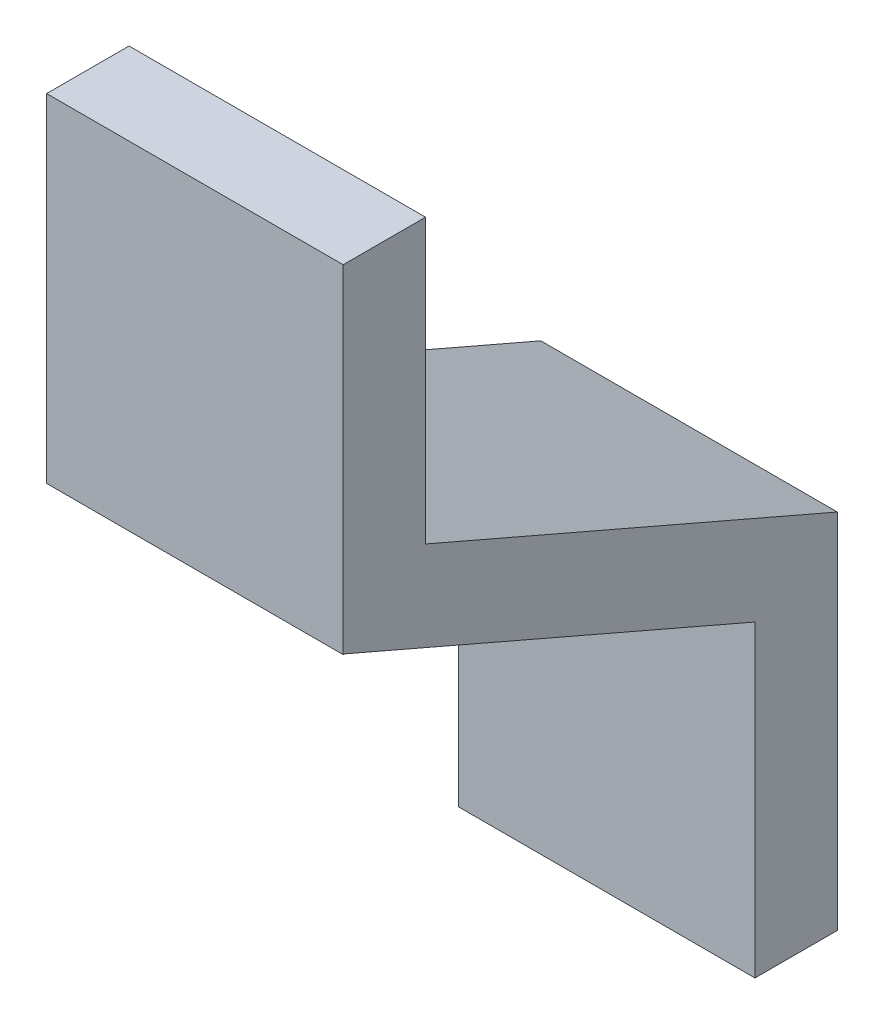
ISO-10303-21;
HEADER;
FILE_DESCRIPTION(('STEP AP214'),'2;1');
FILE_NAME('part.step','',(''),(''),'','','');
FILE_SCHEMA(('AUTOMOTIVE_DESIGN { 1 0 10303 214 1 1 1 1 }'));
ENDSEC;
DATA;
#1=APPLICATION_CONTEXT('core data for automotive mechanical design processes');
#2=APPLICATION_PROTOCOL_DEFINITION('international standard','automotive_design',2000,#1);
#3=PRODUCT_CONTEXT('',#1,'mechanical');
#4=PRODUCT('Part','Part','',(#3));
#5=PRODUCT_RELATED_PRODUCT_CATEGORY('part','',(#4));
#6=PRODUCT_DEFINITION_FORMATION('','',#4);
#7=PRODUCT_DEFINITION_CONTEXT('part definition',#1,'design');
#8=PRODUCT_DEFINITION('design','',#6,#7);
#9=PRODUCT_DEFINITION_SHAPE('','',#8);
#10=(LENGTH_UNIT() NAMED_UNIT(*) SI_UNIT(.MILLI.,.METRE.));
#11=(NAMED_UNIT(*) PLANE_ANGLE_UNIT() SI_UNIT($,.RADIAN.));
#12=(NAMED_UNIT(*) SI_UNIT($,.STERADIAN.) SOLID_ANGLE_UNIT());
#13=UNCERTAINTY_MEASURE_WITH_UNIT(LENGTH_MEASURE(1.E-05),#10,'distance_accuracy_value','');
#14=(GEOMETRIC_REPRESENTATION_CONTEXT(3) GLOBAL_UNCERTAINTY_ASSIGNED_CONTEXT((#13)) GLOBAL_UNIT_ASSIGNED_CONTEXT((#10,
#11,#12)) REPRESENTATION_CONTEXT('',''));
#15=CARTESIAN_POINT('',(0.,0.,0.));
#16=DIRECTION('',(0.,0.,1.));
#17=DIRECTION('',(1.,0.,0.));
#18=AXIS2_PLACEMENT_3D('',#15,#16,#17);
#19=CARTESIAN_POINT('',(9.82,0.999999996424,0.5));
#20=DIRECTION('',(0.,1.,0.));
#21=DIRECTION('',(0.,0.,1.));
#22=AXIS2_PLACEMENT_3D('',#19,#20,#21);
#23=PLANE('',#22);
#24=DIRECTION('',(1.,0.,0.));
#25=VECTOR('',#24,1.);
#26=CARTESIAN_POINT('',(9.82,0.999999996424,0.5));
#27=LINE('',#26,#25);
#28=CARTESIAN_POINT('',(10.180000014305,0.999999996424,0.5));
#29=VERTEX_POINT('',#28);
#30=CARTESIAN_POINT('',(9.82,0.999999996424,0.5));
#31=VERTEX_POINT('',#30);
#32=EDGE_CURVE('E140',#29,#31,#27,.F.);
#33=ORIENTED_EDGE('',*,*,#32,.T.);
#34=DIRECTION('',(0.,0.,-1.));
#35=VECTOR('',#34,1.);
#36=CARTESIAN_POINT('',(9.82,0.999999996424,0.));
#37=LINE('',#36,#35);
#38=CARTESIAN_POINT('',(9.82,0.999999996424,0.60000000149));
#39=VERTEX_POINT('',#38);
#40=EDGE_CURVE('E133',#31,#39,#37,.F.);
#41=ORIENTED_EDGE('',*,*,#40,.T.);
#42=DIRECTION('',(1.,0.,0.));
#43=VECTOR('',#42,1.);
#44=CARTESIAN_POINT('',(9.82,0.999999996424,0.60000000149));
#45=LINE('',#44,#43);
#46=CARTESIAN_POINT('',(10.180000014305,0.999999996424,0.60000000149));
#47=VERTEX_POINT('',#46);
#48=EDGE_CURVE('E129',#47,#39,#45,.F.);
#49=ORIENTED_EDGE('',*,*,#48,.F.);
#50=DIRECTION('',(0.,0.,-1.));
#51=VECTOR('',#50,1.);
#52=CARTESIAN_POINT('',(10.180000014305,0.999999996424,0.));
#53=LINE('',#52,#51);
#54=EDGE_CURVE('E106',#29,#47,#53,.F.);
#55=ORIENTED_EDGE('',*,*,#54,.F.);
#56=EDGE_LOOP('',(#33,#41,#49,#55));
#57=FACE_BOUND('',#56,.T.);
#58=ADVANCED_FACE('F17',(#57),#23,.T.);
#59=CARTESIAN_POINT('',(9.82,0.59,0.60000000149));
#60=DIRECTION('',(0.,0.,1.));
#61=DIRECTION('',(1.,0.,0.));
#62=AXIS2_PLACEMENT_3D('',#59,#60,#61);
#63=PLANE('',#62);
#64=DIRECTION('',(0.,1.,0.));
#65=VECTOR('',#64,1.);
#66=CARTESIAN_POINT('',(9.82,0.44,0.60000000149));
#67=LINE('',#66,#65);
#68=CARTESIAN_POINT('',(9.82,0.59,0.60000000149));
#69=VERTEX_POINT('',#68);
#70=EDGE_CURVE('E136',#39,#69,#67,.F.);
#71=ORIENTED_EDGE('',*,*,#70,.T.);
#72=DIRECTION('',(1.,0.,0.));
#73=VECTOR('',#72,1.);
#74=CARTESIAN_POINT('',(9.82,0.59,0.60000000149));
#75=LINE('',#74,#73);
#76=CARTESIAN_POINT('',(10.180000014305,0.59,0.60000000149));
#77=VERTEX_POINT('',#76);
#78=EDGE_CURVE('E92',#69,#77,#75,.T.);
#79=ORIENTED_EDGE('',*,*,#78,.T.);
#80=DIRECTION('',(0.,1.,0.));
#81=VECTOR('',#80,1.);
#82=CARTESIAN_POINT('',(10.180000014305,0.44,0.60000000149));
#83=LINE('',#82,#81);
#84=EDGE_CURVE('E73',#47,#77,#83,.F.);
#85=ORIENTED_EDGE('',*,*,#84,.F.);
#86=ORIENTED_EDGE('',*,*,#48,.T.);
#87=EDGE_LOOP('',(#71,#79,#85,#86));
#88=FACE_BOUND('',#87,.T.);
#89=ADVANCED_FACE('F285',(#88),#63,.T.);
#90=CARTESIAN_POINT('',(9.82,0.59,0.5));
#91=DIRECTION('',(0.,1.,0.));
#92=DIRECTION('',(0.,0.,1.));
#93=AXIS2_PLACEMENT_3D('',#90,#91,#92);
#94=PLANE('',#93);
#95=DIRECTION('',(1.,0.,0.));
#96=VECTOR('',#95,1.);
#97=CARTESIAN_POINT('',(9.82,0.590000000000416,0.59842599626982));
#98=LINE('',#97,#96);
#99=CARTESIAN_POINT('',(10.180000014305,0.590000000000104,0.598425996269911));
#100=VERTEX_POINT('',#99);
#101=CARTESIAN_POINT('',(9.82,0.590000000000104,0.59842599626991));
#102=VERTEX_POINT('',#101);
#103=EDGE_CURVE('E84',#100,#102,#98,.F.);
#104=ORIENTED_EDGE('',*,*,#103,.F.);
#105=DIRECTION('',(0.,0.,-1.));
#106=VECTOR('',#105,1.);
#107=CARTESIAN_POINT('',(10.180000014305,0.59,0.));
#108=LINE('',#107,#106);
#109=EDGE_CURVE('E20',#77,#100,#108,.T.);
#110=ORIENTED_EDGE('',*,*,#109,.F.);
#111=ORIENTED_EDGE('',*,*,#78,.F.);
#112=DIRECTION('',(0.,0.,1.));
#113=VECTOR('',#112,1.);
#114=CARTESIAN_POINT('',(9.82,0.59,0.5));
#115=LINE('',#114,#113);
#116=EDGE_CURVE('E87',#69,#102,#115,.F.);
#117=ORIENTED_EDGE('',*,*,#116,.T.);
#118=EDGE_LOOP('',(#104,#110,#111,#117));
#119=FACE_BOUND('',#118,.T.);
#120=ADVANCED_FACE('F85',(#119),#94,.F.);
#121=CARTESIAN_POINT('',(9.82,0.348224508223,0.03971472531736));
#122=DIRECTION('',(0.,-0.917754904098641,0.397147247255844));
#123=DIRECTION('',(0.,-0.397147247255844,-0.917754904098641));
#124=AXIS2_PLACEMENT_3D('',#121,#122,#123);
#125=PLANE('',#124);
#126=DIRECTION('',(0.,-0.397147247255413,-0.917754904098827));
#127=VECTOR('',#126,1.);
#128=CARTESIAN_POINT('',(10.180000014305,0.59,0.59842599627));
#129=LINE('',#128,#127);
#130=CARTESIAN_POINT('',(10.180000014305,0.37431222660502,0.10000000149));
#131=VERTEX_POINT('',#130);
#132=EDGE_CURVE('E80',#100,#131,#129,.T.);
#133=ORIENTED_EDGE('',*,*,#132,.F.);
#134=ORIENTED_EDGE('',*,*,#103,.T.);
#135=DIRECTION('',(0.,-0.397147247255413,-0.917754904098827));
#136=VECTOR('',#135,1.);
#137=CARTESIAN_POINT('',(9.82,0.59,0.59842599627));
#138=LINE('',#137,#136);
#139=CARTESIAN_POINT('',(9.82,0.374312226605,0.10000000149));
#140=VERTEX_POINT('',#139);
#141=EDGE_CURVE('E122',#102,#140,#138,.T.);
#142=ORIENTED_EDGE('',*,*,#141,.T.);
#143=DIRECTION('',(1.,0.,0.));
#144=VECTOR('',#143,1.);
#145=CARTESIAN_POINT('',(9.82,0.374312226605,0.10000000149));
#146=LINE('',#145,#144);
#147=EDGE_CURVE('E91',#131,#140,#146,.F.);
#148=ORIENTED_EDGE('',*,*,#147,.F.);
#149=EDGE_LOOP('',(#133,#134,#142,#148));
#150=FACE_BOUND('',#149,.T.);
#151=ADVANCED_FACE('F94',(#150),#125,.T.);
#152=CARTESIAN_POINT('',(9.82,0.,0.10000000149));
#153=DIRECTION('',(0.,0.,1.));
#154=DIRECTION('',(1.,0.,0.));
#155=AXIS2_PLACEMENT_3D('',#152,#153,#154);
#156=PLANE('',#155);
#157=ORIENTED_EDGE('',*,*,#147,.T.);
#158=DIRECTION('',(0.,1.,0.));
#159=VECTOR('',#158,1.);
#160=CARTESIAN_POINT('',(9.82,0.44,0.10000000149));
#161=LINE('',#160,#159);
#162=CARTESIAN_POINT('',(9.82,0.,0.10000000149));
#163=VERTEX_POINT('',#162);
#164=EDGE_CURVE('E118',#140,#163,#161,.F.);
#165=ORIENTED_EDGE('',*,*,#164,.T.);
#166=DIRECTION('',(1.,0.,0.));
#167=VECTOR('',#166,1.);
#168=CARTESIAN_POINT('',(9.82,0.,0.10000000149));
#169=LINE('',#168,#167);
#170=CARTESIAN_POINT('',(10.180000014305,0.,0.10000000149));
#171=VERTEX_POINT('',#170);
#172=EDGE_CURVE('E115',#163,#171,#169,.T.);
#173=ORIENTED_EDGE('',*,*,#172,.T.);
#174=DIRECTION('',(0.,1.,0.));
#175=VECTOR('',#174,1.);
#176=CARTESIAN_POINT('',(10.180000014305,0.44,0.10000000149));
#177=LINE('',#176,#175);
#178=EDGE_CURVE('E96',#131,#171,#177,.F.);
#179=ORIENTED_EDGE('',*,*,#178,.F.);
#180=EDGE_LOOP('',(#157,#165,#173,#179));
#181=FACE_BOUND('',#180,.T.);
#182=ADVANCED_FACE('F202',(#181),#156,.T.);
#183=CARTESIAN_POINT('',(9.82,0.,0.));
#184=DIRECTION('',(0.,1.,0.));
#185=DIRECTION('',(0.,0.,1.));
#186=AXIS2_PLACEMENT_3D('',#183,#184,#185);
#187=PLANE('',#186);
#188=DIRECTION('',(0.,0.,-1.));
#189=VECTOR('',#188,1.);
#190=CARTESIAN_POINT('',(9.82,0.,0.));
#191=LINE('',#190,#189);
#192=CARTESIAN_POINT('',(9.82,0.,0.));
#193=VERTEX_POINT('',#192);
#194=EDGE_CURVE('E121',#163,#193,#191,.T.);
#195=ORIENTED_EDGE('',*,*,#194,.T.);
#196=DIRECTION('',(1.,0.,0.));
#197=VECTOR('',#196,1.);
#198=CARTESIAN_POINT('',(9.82,0.,0.));
#199=LINE('',#198,#197);
#200=CARTESIAN_POINT('',(10.180000014305,0.,0.));
#201=VERTEX_POINT('',#200);
#202=EDGE_CURVE('E112',#193,#201,#199,.T.);
#203=ORIENTED_EDGE('',*,*,#202,.T.);
#204=DIRECTION('',(0.,0.,-1.));
#205=VECTOR('',#204,1.);
#206=CARTESIAN_POINT('',(10.180000014305,0.,0.));
#207=LINE('',#206,#205);
#208=EDGE_CURVE('E98',#171,#201,#207,.T.);
#209=ORIENTED_EDGE('',*,*,#208,.F.);
#210=ORIENTED_EDGE('',*,*,#172,.F.);
#211=EDGE_LOOP('',(#195,#203,#209,#210));
#212=FACE_BOUND('',#211,.T.);
#213=ADVANCED_FACE('F206',(#212),#187,.F.);
#214=CARTESIAN_POINT('',(9.82,0.,0.));
#215=DIRECTION('',(0.,0.,1.));
#216=DIRECTION('',(1.,0.,0.));
#217=AXIS2_PLACEMENT_3D('',#214,#215,#216);
#218=PLANE('',#217);
#219=ORIENTED_EDGE('',*,*,#202,.F.);
#220=DIRECTION('',(0.,1.,0.));
#221=VECTOR('',#220,1.);
#222=CARTESIAN_POINT('',(9.82,0.44,0.));
#223=LINE('',#222,#221);
#224=CARTESIAN_POINT('',(9.82,0.439999998997445,-1.94673175919965E-10));
#225=VERTEX_POINT('',#224);
#226=EDGE_CURVE('E178',#193,#225,#223,.T.);
#227=ORIENTED_EDGE('',*,*,#226,.T.);
#228=DIRECTION('',(1.,0.,0.));
#229=VECTOR('',#228,1.);
#230=CARTESIAN_POINT('',(9.82,0.43999999966303,-7.78692710220355E-10));
#231=LINE('',#230,#229);
#232=CARTESIAN_POINT('',(10.180000014305,0.439999998997445,-1.94673175919965E-10));
#233=VERTEX_POINT('',#232);
#234=EDGE_CURVE('E163',#225,#233,#231,.T.);
#235=ORIENTED_EDGE('',*,*,#234,.T.);
#236=DIRECTION('',(0.,1.,0.));
#237=VECTOR('',#236,1.);
#238=CARTESIAN_POINT('',(10.180000014305,0.44,0.));
#239=LINE('',#238,#237);
#240=EDGE_CURVE('E109',#201,#233,#239,.T.);
#241=ORIENTED_EDGE('',*,*,#240,.F.);
#242=EDGE_LOOP('',(#219,#227,#235,#241));
#243=FACE_BOUND('',#242,.T.);
#244=ADVANCED_FACE('F186',(#243),#218,.F.);
#245=CARTESIAN_POINT('',(10.180000014305,0.44,0.));
#246=DIRECTION('',(1.,0.,0.));
#247=DIRECTION('',(0.,0.,-1.));
#248=AXIS2_PLACEMENT_3D('',#245,#246,#247);
#249=PLANE('',#248);
#250=ORIENTED_EDGE('',*,*,#178,.T.);
#251=ORIENTED_EDGE('',*,*,#208,.T.);
#252=ORIENTED_EDGE('',*,*,#240,.T.);
#253=DIRECTION('',(0.,-0.397147247255844,-0.917754904098641));
#254=VECTOR('',#253,1.);
#255=CARTESIAN_POINT('',(10.180000014305,0.44,0.));
#256=LINE('',#255,#254);
#257=CARTESIAN_POINT('',(10.180000014305,0.656368904967003,0.499999999999999));
#258=VERTEX_POINT('',#257);
#259=EDGE_CURVE('E151',#233,#258,#256,.F.);
#260=ORIENTED_EDGE('',*,*,#259,.T.);
#261=DIRECTION('',(0.,1.,0.));
#262=VECTOR('',#261,1.);
#263=CARTESIAN_POINT('',(10.180000014305,0.59,0.5));
#264=LINE('',#263,#262);
#265=EDGE_CURVE('E144',#258,#29,#264,.T.);
#266=ORIENTED_EDGE('',*,*,#265,.T.);
#267=ORIENTED_EDGE('',*,*,#54,.T.);
#268=ORIENTED_EDGE('',*,*,#84,.T.);
#269=ORIENTED_EDGE('',*,*,#109,.T.);
#270=ORIENTED_EDGE('',*,*,#132,.T.);
#271=EDGE_LOOP('',(#250,#251,#252,#260,#266,#267,#268,#269,#270));
#272=FACE_BOUND('',#271,.T.);
#273=ADVANCED_FACE('F78',(#272),#249,.T.);
#274=CARTESIAN_POINT('',(9.82,0.59,0.5));
#275=DIRECTION('',(0.,0.,1.));
#276=DIRECTION('',(1.,0.,0.));
#277=AXIS2_PLACEMENT_3D('',#274,#275,#276);
#278=PLANE('',#277);
#279=ORIENTED_EDGE('',*,*,#265,.F.);
#280=DIRECTION('',(1.,0.,0.));
#281=VECTOR('',#280,1.);
#282=CARTESIAN_POINT('',(9.82,0.656368904967005,0.499999999999998));
#283=LINE('',#282,#281);
#284=CARTESIAN_POINT('',(9.82,0.656368904967001,0.5));
#285=VERTEX_POINT('',#284);
#286=EDGE_CURVE('E26',#258,#285,#283,.F.);
#287=ORIENTED_EDGE('',*,*,#286,.T.);
#288=DIRECTION('',(0.,1.,0.));
#289=VECTOR('',#288,1.);
#290=CARTESIAN_POINT('',(9.82,0.44,0.5));
#291=LINE('',#290,#289);
#292=EDGE_CURVE('E34',#285,#31,#291,.T.);
#293=ORIENTED_EDGE('',*,*,#292,.T.);
#294=ORIENTED_EDGE('',*,*,#32,.F.);
#295=EDGE_LOOP('',(#279,#287,#293,#294));
#296=FACE_BOUND('',#295,.T.);
#297=ADVANCED_FACE('F212',(#296),#278,.F.);
#298=CARTESIAN_POINT('',(9.82,0.44,0.));
#299=DIRECTION('',(1.,0.,0.));
#300=DIRECTION('',(0.,0.,-1.));
#301=AXIS2_PLACEMENT_3D('',#298,#299,#300);
#302=PLANE('',#301);
#303=ORIENTED_EDGE('',*,*,#226,.F.);
#304=ORIENTED_EDGE('',*,*,#194,.F.);
#305=ORIENTED_EDGE('',*,*,#164,.F.);
#306=ORIENTED_EDGE('',*,*,#141,.F.);
#307=ORIENTED_EDGE('',*,*,#116,.F.);
#308=ORIENTED_EDGE('',*,*,#70,.F.);
#309=ORIENTED_EDGE('',*,*,#40,.F.);
#310=ORIENTED_EDGE('',*,*,#292,.F.);
#311=DIRECTION('',(0.,-0.397147247255844,-0.917754904098641));
#312=VECTOR('',#311,1.);
#313=CARTESIAN_POINT('',(9.82,0.44,0.));
#314=LINE('',#313,#312);
#315=EDGE_CURVE('E11',#285,#225,#314,.T.);
#316=ORIENTED_EDGE('',*,*,#315,.T.);
#317=EDGE_LOOP('',(#303,#304,#305,#306,#307,#308,#309,#310,#316));
#318=FACE_BOUND('',#317,.T.);
#319=ADVANCED_FACE('F207',(#318),#302,.F.);
#320=CARTESIAN_POINT('',(9.82,0.44,0.));
#321=DIRECTION('',(0.,-0.917754904098641,0.397147247255844));
#322=DIRECTION('',(0.,-0.397147247255844,-0.917754904098641));
#323=AXIS2_PLACEMENT_3D('',#320,#321,#322);
#324=PLANE('',#323);
#325=ORIENTED_EDGE('',*,*,#286,.F.);
#326=ORIENTED_EDGE('',*,*,#259,.F.);
#327=ORIENTED_EDGE('',*,*,#234,.F.);
#328=ORIENTED_EDGE('',*,*,#315,.F.);
#329=EDGE_LOOP('',(#325,#326,#327,#328));
#330=FACE_BOUND('',#329,.T.);
#331=ADVANCED_FACE('F193',(#330),#324,.F.);
#332=CLOSED_SHELL('',(#58,#89,#120,#151,#182,#213,#244,#273,#297,#319,#331));
#333=MANIFOLD_SOLID_BREP('B1',#332);
#334=ADVANCED_BREP_SHAPE_REPRESENTATION('',(#18,#333),#14);
#335=SHAPE_DEFINITION_REPRESENTATION(#9,#334);
ENDSEC;
END-ISO-10303-21;
